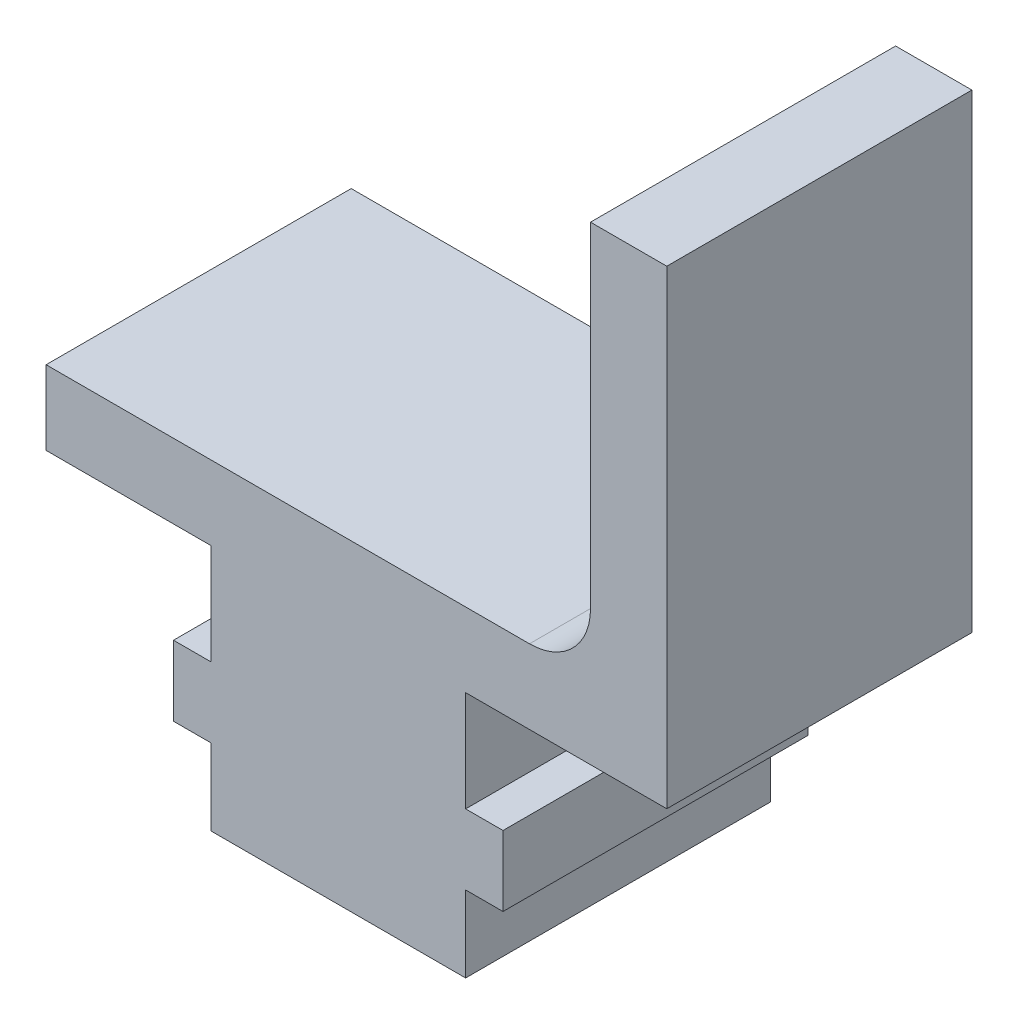
ISO-10303-21;
HEADER;
FILE_DESCRIPTION(('STEP AP214'),'2;1');
FILE_NAME('part.step','',(''),(''),'','','');
FILE_SCHEMA(('AUTOMOTIVE_DESIGN { 1 0 10303 214 1 1 1 1 }'));
ENDSEC;
DATA;
#1=APPLICATION_CONTEXT('core data for automotive mechanical design processes');
#2=APPLICATION_PROTOCOL_DEFINITION('international standard','automotive_design',2000,#1);
#3=PRODUCT_CONTEXT('',#1,'mechanical');
#4=PRODUCT('Part','Part','',(#3));
#5=PRODUCT_RELATED_PRODUCT_CATEGORY('part','',(#4));
#6=PRODUCT_DEFINITION_FORMATION('','',#4);
#7=PRODUCT_DEFINITION_CONTEXT('part definition',#1,'design');
#8=PRODUCT_DEFINITION('design','',#6,#7);
#9=PRODUCT_DEFINITION_SHAPE('','',#8);
#10=(LENGTH_UNIT() NAMED_UNIT(*) SI_UNIT(.MILLI.,.METRE.));
#11=(NAMED_UNIT(*) PLANE_ANGLE_UNIT() SI_UNIT($,.RADIAN.));
#12=(NAMED_UNIT(*) SI_UNIT($,.STERADIAN.) SOLID_ANGLE_UNIT());
#13=UNCERTAINTY_MEASURE_WITH_UNIT(LENGTH_MEASURE(1.E-05),#10,'distance_accuracy_value','');
#14=(GEOMETRIC_REPRESENTATION_CONTEXT(3) GLOBAL_UNCERTAINTY_ASSIGNED_CONTEXT((#13)) GLOBAL_UNIT_ASSIGNED_CONTEXT((#10,
#11,#12)) REPRESENTATION_CONTEXT('',''));
#15=CARTESIAN_POINT('',(0.,0.,0.));
#16=DIRECTION('',(0.,0.,1.));
#17=DIRECTION('',(1.,0.,0.));
#18=AXIS2_PLACEMENT_3D('',#15,#16,#17);
#19=CARTESIAN_POINT('',(-6.858,0.,12.7));
#20=DIRECTION('',(0.,1.,0.));
#21=DIRECTION('',(0.,0.,1.));
#22=AXIS2_PLACEMENT_3D('',#19,#20,#21);
#23=PLANE('',#22);
#24=DIRECTION('',(1.,0.,0.));
#25=VECTOR('',#24,1.);
#26=CARTESIAN_POINT('',(-6.858,0.,0.));
#27=LINE('',#26,#25);
#28=CARTESIAN_POINT('',(-6.858,0.,0.));
#29=VERTEX_POINT('',#28);
#30=CARTESIAN_POINT('',(0.,0.,0.));
#31=VERTEX_POINT('',#30);
#32=EDGE_CURVE('E190',#29,#31,#27,.T.);
#33=ORIENTED_EDGE('',*,*,#32,.T.);
#34=DIRECTION('',(0.,0.,-1.));
#35=VECTOR('',#34,1.);
#36=CARTESIAN_POINT('',(0.,0.,12.7));
#37=LINE('',#36,#35);
#38=CARTESIAN_POINT('',(0.,0.,12.7));
#39=VERTEX_POINT('',#38);
#40=EDGE_CURVE('E171',#39,#31,#37,.T.);
#41=ORIENTED_EDGE('',*,*,#40,.F.);
#42=DIRECTION('',(1.,0.,0.));
#43=VECTOR('',#42,1.);
#44=CARTESIAN_POINT('',(-6.858,0.,12.7));
#45=LINE('',#44,#43);
#46=CARTESIAN_POINT('',(-6.858,0.,12.7));
#47=VERTEX_POINT('',#46);
#48=EDGE_CURVE('E178',#47,#39,#45,.T.);
#49=ORIENTED_EDGE('',*,*,#48,.F.);
#50=DIRECTION('',(0.,0.,-1.));
#51=VECTOR('',#50,1.);
#52=CARTESIAN_POINT('',(-6.858,0.,12.7));
#53=LINE('',#52,#51);
#54=EDGE_CURVE('E240',#47,#29,#53,.T.);
#55=ORIENTED_EDGE('',*,*,#54,.T.);
#56=EDGE_LOOP('',(#33,#41,#49,#55));
#57=FACE_BOUND('',#56,.T.);
#58=ADVANCED_FACE('F36',(#57),#23,.F.);
#59=CARTESIAN_POINT('',(0.,0.,12.7));
#60=DIRECTION('',(1.,0.,0.));
#61=DIRECTION('',(0.,1.,0.));
#62=AXIS2_PLACEMENT_3D('',#59,#60,#61);
#63=PLANE('',#62);
#64=DIRECTION('',(0.,-1.,0.));
#65=VECTOR('',#64,1.);
#66=CARTESIAN_POINT('',(0.,0.,0.));
#67=LINE('',#66,#65);
#68=CARTESIAN_POINT('',(0.,-4.191,0.));
#69=VERTEX_POINT('',#68);
#70=EDGE_CURVE('E273',#31,#69,#67,.T.);
#71=ORIENTED_EDGE('',*,*,#70,.T.);
#72=DIRECTION('',(0.,0.,-1.));
#73=VECTOR('',#72,1.);
#74=CARTESIAN_POINT('',(0.,-4.191,12.7));
#75=LINE('',#74,#73);
#76=CARTESIAN_POINT('',(0.,-4.191,12.7));
#77=VERTEX_POINT('',#76);
#78=EDGE_CURVE('E174',#77,#69,#75,.T.);
#79=ORIENTED_EDGE('',*,*,#78,.F.);
#80=DIRECTION('',(0.,-1.,0.));
#81=VECTOR('',#80,1.);
#82=CARTESIAN_POINT('',(0.,0.,12.7));
#83=LINE('',#82,#81);
#84=EDGE_CURVE('E167',#39,#77,#83,.T.);
#85=ORIENTED_EDGE('',*,*,#84,.F.);
#86=ORIENTED_EDGE('',*,*,#40,.T.);
#87=EDGE_LOOP('',(#71,#79,#85,#86));
#88=FACE_BOUND('',#87,.T.);
#89=ADVANCED_FACE('F169',(#88),#63,.F.);
#90=CARTESIAN_POINT('',(0.,-4.191,12.7));
#91=DIRECTION('',(0.,-1.,0.));
#92=DIRECTION('',(1.,0.,0.));
#93=AXIS2_PLACEMENT_3D('',#90,#91,#92);
#94=PLANE('',#93);
#95=DIRECTION('',(-1.,0.,0.));
#96=VECTOR('',#95,1.);
#97=CARTESIAN_POINT('',(0.,-4.191,0.));
#98=LINE('',#97,#96);
#99=CARTESIAN_POINT('',(-1.55575,-4.191,0.));
#100=VERTEX_POINT('',#99);
#101=EDGE_CURVE('E271',#69,#100,#98,.T.);
#102=ORIENTED_EDGE('',*,*,#101,.T.);
#103=DIRECTION('',(0.,0.,-1.));
#104=VECTOR('',#103,1.);
#105=CARTESIAN_POINT('',(-1.55575,-4.191,12.7));
#106=LINE('',#105,#104);
#107=CARTESIAN_POINT('',(-1.55575,-4.191,12.7));
#108=VERTEX_POINT('',#107);
#109=EDGE_CURVE('E195',#108,#100,#106,.T.);
#110=ORIENTED_EDGE('',*,*,#109,.F.);
#111=DIRECTION('',(-1.,0.,0.));
#112=VECTOR('',#111,1.);
#113=CARTESIAN_POINT('',(0.,-4.191,12.7));
#114=LINE('',#113,#112);
#115=EDGE_CURVE('E177',#77,#108,#114,.T.);
#116=ORIENTED_EDGE('',*,*,#115,.F.);
#117=ORIENTED_EDGE('',*,*,#78,.T.);
#118=EDGE_LOOP('',(#102,#110,#116,#117));
#119=FACE_BOUND('',#118,.T.);
#120=ADVANCED_FACE('F309',(#119),#94,.F.);
#121=CARTESIAN_POINT('',(-1.55575,-4.191,12.7));
#122=DIRECTION('',(1.,0.,0.));
#123=DIRECTION('',(0.,0.,-1.));
#124=AXIS2_PLACEMENT_3D('',#121,#122,#123);
#125=PLANE('',#124);
#126=DIRECTION('',(0.,-1.,0.));
#127=VECTOR('',#126,1.);
#128=CARTESIAN_POINT('',(-1.55575,-4.191,0.));
#129=LINE('',#128,#127);
#130=CARTESIAN_POINT('',(-1.55575,-7.112,0.));
#131=VERTEX_POINT('',#130);
#132=EDGE_CURVE('E269',#100,#131,#129,.T.);
#133=ORIENTED_EDGE('',*,*,#132,.T.);
#134=DIRECTION('',(0.,0.,-1.));
#135=VECTOR('',#134,1.);
#136=CARTESIAN_POINT('',(-1.55575,-7.112,12.7));
#137=LINE('',#136,#135);
#138=CARTESIAN_POINT('',(-1.55575,-7.112,12.7));
#139=VERTEX_POINT('',#138);
#140=EDGE_CURVE('E201',#139,#131,#137,.T.);
#141=ORIENTED_EDGE('',*,*,#140,.F.);
#142=DIRECTION('',(0.,-1.,0.));
#143=VECTOR('',#142,1.);
#144=CARTESIAN_POINT('',(-1.55575,-4.191,12.7));
#145=LINE('',#144,#143);
#146=EDGE_CURVE('E303',#108,#139,#145,.T.);
#147=ORIENTED_EDGE('',*,*,#146,.F.);
#148=ORIENTED_EDGE('',*,*,#109,.T.);
#149=EDGE_LOOP('',(#133,#141,#147,#148));
#150=FACE_BOUND('',#149,.T.);
#151=ADVANCED_FACE('F313',(#150),#125,.F.);
#152=CARTESIAN_POINT('',(-1.55575,-7.112,12.7));
#153=DIRECTION('',(0.,1.,0.));
#154=DIRECTION('',(0.,0.,1.));
#155=AXIS2_PLACEMENT_3D('',#152,#153,#154);
#156=PLANE('',#155);
#157=DIRECTION('',(1.,0.,0.));
#158=VECTOR('',#157,1.);
#159=CARTESIAN_POINT('',(-1.55575,-7.112,0.));
#160=LINE('',#159,#158);
#161=CARTESIAN_POINT('',(0.,-7.112,0.));
#162=VERTEX_POINT('',#161);
#163=EDGE_CURVE('E267',#131,#162,#160,.T.);
#164=ORIENTED_EDGE('',*,*,#163,.T.);
#165=DIRECTION('',(0.,0.,-1.));
#166=VECTOR('',#165,1.);
#167=CARTESIAN_POINT('',(0.,-7.112,12.7));
#168=LINE('',#167,#166);
#169=CARTESIAN_POINT('',(0.,-7.112,12.7));
#170=VERTEX_POINT('',#169);
#171=EDGE_CURVE('E204',#170,#162,#168,.T.);
#172=ORIENTED_EDGE('',*,*,#171,.F.);
#173=DIRECTION('',(1.,0.,0.));
#174=VECTOR('',#173,1.);
#175=CARTESIAN_POINT('',(-1.55575,-7.112,12.7));
#176=LINE('',#175,#174);
#177=EDGE_CURVE('E301',#139,#170,#176,.T.);
#178=ORIENTED_EDGE('',*,*,#177,.F.);
#179=ORIENTED_EDGE('',*,*,#140,.T.);
#180=EDGE_LOOP('',(#164,#172,#178,#179));
#181=FACE_BOUND('',#180,.T.);
#182=ADVANCED_FACE('F318',(#181),#156,.F.);
#183=CARTESIAN_POINT('',(0.,-7.112,12.7));
#184=DIRECTION('',(1.,0.,0.));
#185=DIRECTION('',(0.,1.,0.));
#186=AXIS2_PLACEMENT_3D('',#183,#184,#185);
#187=PLANE('',#186);
#188=DIRECTION('',(0.,-1.,0.));
#189=VECTOR('',#188,1.);
#190=CARTESIAN_POINT('',(0.,-7.112,0.));
#191=LINE('',#190,#189);
#192=CARTESIAN_POINT('',(0.,-10.287,0.));
#193=VERTEX_POINT('',#192);
#194=EDGE_CURVE('E265',#162,#193,#191,.T.);
#195=ORIENTED_EDGE('',*,*,#194,.T.);
#196=DIRECTION('',(0.,0.,-1.));
#197=VECTOR('',#196,1.);
#198=CARTESIAN_POINT('',(0.,-10.287,12.7));
#199=LINE('',#198,#197);
#200=CARTESIAN_POINT('',(0.,-10.287,12.7));
#201=VERTEX_POINT('',#200);
#202=EDGE_CURVE('E207',#201,#193,#199,.T.);
#203=ORIENTED_EDGE('',*,*,#202,.F.);
#204=DIRECTION('',(0.,-1.,0.));
#205=VECTOR('',#204,1.);
#206=CARTESIAN_POINT('',(0.,-7.112,12.7));
#207=LINE('',#206,#205);
#208=EDGE_CURVE('E299',#170,#201,#207,.T.);
#209=ORIENTED_EDGE('',*,*,#208,.F.);
#210=ORIENTED_EDGE('',*,*,#171,.T.);
#211=EDGE_LOOP('',(#195,#203,#209,#210));
#212=FACE_BOUND('',#211,.T.);
#213=ADVANCED_FACE('F324',(#212),#187,.F.);
#214=CARTESIAN_POINT('',(0.,-10.287,12.7));
#215=DIRECTION('',(0.,1.,0.));
#216=DIRECTION('',(0.,0.,1.));
#217=AXIS2_PLACEMENT_3D('',#214,#215,#216);
#218=PLANE('',#217);
#219=DIRECTION('',(1.,0.,0.));
#220=VECTOR('',#219,1.);
#221=CARTESIAN_POINT('',(0.,-10.287,0.));
#222=LINE('',#221,#220);
#223=CARTESIAN_POINT('',(10.6045,-10.287,0.));
#224=VERTEX_POINT('',#223);
#225=EDGE_CURVE('E263',#193,#224,#222,.T.);
#226=ORIENTED_EDGE('',*,*,#225,.T.);
#227=DIRECTION('',(0.,0.,-1.));
#228=VECTOR('',#227,1.);
#229=CARTESIAN_POINT('',(10.6045,-10.287,12.7));
#230=LINE('',#229,#228);
#231=CARTESIAN_POINT('',(10.6045,-10.287,12.7));
#232=VERTEX_POINT('',#231);
#233=EDGE_CURVE('E210',#232,#224,#230,.T.);
#234=ORIENTED_EDGE('',*,*,#233,.F.);
#235=DIRECTION('',(1.,0.,0.));
#236=VECTOR('',#235,1.);
#237=CARTESIAN_POINT('',(0.,-10.287,12.7));
#238=LINE('',#237,#236);
#239=EDGE_CURVE('E297',#201,#232,#238,.T.);
#240=ORIENTED_EDGE('',*,*,#239,.F.);
#241=ORIENTED_EDGE('',*,*,#202,.T.);
#242=EDGE_LOOP('',(#226,#234,#240,#241));
#243=FACE_BOUND('',#242,.T.);
#244=ADVANCED_FACE('F328',(#243),#218,.F.);
#245=CARTESIAN_POINT('',(10.6045,-10.287,12.7));
#246=DIRECTION('',(-1.,0.,0.));
#247=DIRECTION('',(0.,0.,1.));
#248=AXIS2_PLACEMENT_3D('',#245,#246,#247);
#249=PLANE('',#248);
#250=DIRECTION('',(0.,1.,0.));
#251=VECTOR('',#250,1.);
#252=CARTESIAN_POINT('',(10.6045,-10.287,0.));
#253=LINE('',#252,#251);
#254=CARTESIAN_POINT('',(10.6045,-7.112,0.));
#255=VERTEX_POINT('',#254);
#256=EDGE_CURVE('E261',#224,#255,#253,.T.);
#257=ORIENTED_EDGE('',*,*,#256,.T.);
#258=DIRECTION('',(0.,0.,-1.));
#259=VECTOR('',#258,1.);
#260=CARTESIAN_POINT('',(10.6045,-7.112,12.7));
#261=LINE('',#260,#259);
#262=CARTESIAN_POINT('',(10.6045,-7.112,12.7));
#263=VERTEX_POINT('',#262);
#264=EDGE_CURVE('E213',#263,#255,#261,.T.);
#265=ORIENTED_EDGE('',*,*,#264,.F.);
#266=DIRECTION('',(0.,1.,0.));
#267=VECTOR('',#266,1.);
#268=CARTESIAN_POINT('',(10.6045,-10.287,12.7));
#269=LINE('',#268,#267);
#270=EDGE_CURVE('E295',#232,#263,#269,.T.);
#271=ORIENTED_EDGE('',*,*,#270,.F.);
#272=ORIENTED_EDGE('',*,*,#233,.T.);
#273=EDGE_LOOP('',(#257,#265,#271,#272));
#274=FACE_BOUND('',#273,.T.);
#275=ADVANCED_FACE('F333',(#274),#249,.F.);
#276=CARTESIAN_POINT('',(10.6045,-7.112,12.7));
#277=DIRECTION('',(0.,1.,0.));
#278=DIRECTION('',(0.,0.,1.));
#279=AXIS2_PLACEMENT_3D('',#276,#277,#278);
#280=PLANE('',#279);
#281=DIRECTION('',(1.,0.,0.));
#282=VECTOR('',#281,1.);
#283=CARTESIAN_POINT('',(10.6045,-7.112,0.));
#284=LINE('',#283,#282);
#285=CARTESIAN_POINT('',(12.16025,-7.112,0.));
#286=VERTEX_POINT('',#285);
#287=EDGE_CURVE('E259',#255,#286,#284,.T.);
#288=ORIENTED_EDGE('',*,*,#287,.T.);
#289=DIRECTION('',(0.,0.,-1.));
#290=VECTOR('',#289,1.);
#291=CARTESIAN_POINT('',(12.16025,-7.112,12.7));
#292=LINE('',#291,#290);
#293=CARTESIAN_POINT('',(12.16025,-7.112,12.7));
#294=VERTEX_POINT('',#293);
#295=EDGE_CURVE('E216',#294,#286,#292,.T.);
#296=ORIENTED_EDGE('',*,*,#295,.F.);
#297=DIRECTION('',(1.,0.,0.));
#298=VECTOR('',#297,1.);
#299=CARTESIAN_POINT('',(10.6045,-7.112,12.7));
#300=LINE('',#299,#298);
#301=EDGE_CURVE('E293',#263,#294,#300,.T.);
#302=ORIENTED_EDGE('',*,*,#301,.F.);
#303=ORIENTED_EDGE('',*,*,#264,.T.);
#304=EDGE_LOOP('',(#288,#296,#302,#303));
#305=FACE_BOUND('',#304,.T.);
#306=ADVANCED_FACE('F339',(#305),#280,.F.);
#307=CARTESIAN_POINT('',(12.16025,-7.112,12.7));
#308=DIRECTION('',(-1.,0.,0.));
#309=DIRECTION('',(0.,0.,1.));
#310=AXIS2_PLACEMENT_3D('',#307,#308,#309);
#311=PLANE('',#310);
#312=DIRECTION('',(0.,1.,0.));
#313=VECTOR('',#312,1.);
#314=CARTESIAN_POINT('',(12.16025,-7.112,0.));
#315=LINE('',#314,#313);
#316=CARTESIAN_POINT('',(12.16025,-4.191,0.));
#317=VERTEX_POINT('',#316);
#318=EDGE_CURVE('E257',#286,#317,#315,.T.);
#319=ORIENTED_EDGE('',*,*,#318,.T.);
#320=DIRECTION('',(0.,0.,-1.));
#321=VECTOR('',#320,1.);
#322=CARTESIAN_POINT('',(12.16025,-4.191,12.7));
#323=LINE('',#322,#321);
#324=CARTESIAN_POINT('',(12.16025,-4.191,12.7));
#325=VERTEX_POINT('',#324);
#326=EDGE_CURVE('E219',#325,#317,#323,.T.);
#327=ORIENTED_EDGE('',*,*,#326,.F.);
#328=DIRECTION('',(0.,1.,0.));
#329=VECTOR('',#328,1.);
#330=CARTESIAN_POINT('',(12.16025,-7.112,12.7));
#331=LINE('',#330,#329);
#332=EDGE_CURVE('E291',#294,#325,#331,.T.);
#333=ORIENTED_EDGE('',*,*,#332,.F.);
#334=ORIENTED_EDGE('',*,*,#295,.T.);
#335=EDGE_LOOP('',(#319,#327,#333,#334));
#336=FACE_BOUND('',#335,.T.);
#337=ADVANCED_FACE('F343',(#336),#311,.F.);
#338=CARTESIAN_POINT('',(12.16025,-4.191,12.7));
#339=DIRECTION('',(0.,-1.,0.));
#340=DIRECTION('',(1.,0.,0.));
#341=AXIS2_PLACEMENT_3D('',#338,#339,#340);
#342=PLANE('',#341);
#343=DIRECTION('',(-1.,0.,0.));
#344=VECTOR('',#343,1.);
#345=CARTESIAN_POINT('',(12.16025,-4.191,0.));
#346=LINE('',#345,#344);
#347=CARTESIAN_POINT('',(10.6045,-4.191,0.));
#348=VERTEX_POINT('',#347);
#349=EDGE_CURVE('E255',#317,#348,#346,.T.);
#350=ORIENTED_EDGE('',*,*,#349,.T.);
#351=DIRECTION('',(0.,0.,-1.));
#352=VECTOR('',#351,1.);
#353=CARTESIAN_POINT('',(10.6045,-4.191,12.7));
#354=LINE('',#353,#352);
#355=CARTESIAN_POINT('',(10.6045,-4.191,12.7));
#356=VERTEX_POINT('',#355);
#357=EDGE_CURVE('E222',#356,#348,#354,.T.);
#358=ORIENTED_EDGE('',*,*,#357,.F.);
#359=DIRECTION('',(-1.,0.,0.));
#360=VECTOR('',#359,1.);
#361=CARTESIAN_POINT('',(12.16025,-4.191,12.7));
#362=LINE('',#361,#360);
#363=EDGE_CURVE('E289',#325,#356,#362,.T.);
#364=ORIENTED_EDGE('',*,*,#363,.F.);
#365=ORIENTED_EDGE('',*,*,#326,.T.);
#366=EDGE_LOOP('',(#350,#358,#364,#365));
#367=FACE_BOUND('',#366,.T.);
#368=ADVANCED_FACE('F348',(#367),#342,.F.);
#369=CARTESIAN_POINT('',(10.6045,-4.191,12.7));
#370=DIRECTION('',(-1.,0.,0.));
#371=DIRECTION('',(0.,0.,1.));
#372=AXIS2_PLACEMENT_3D('',#369,#370,#371);
#373=PLANE('',#372);
#374=DIRECTION('',(0.,1.,0.));
#375=VECTOR('',#374,1.);
#376=CARTESIAN_POINT('',(10.6045,-4.191,0.));
#377=LINE('',#376,#375);
#378=CARTESIAN_POINT('',(10.6045,0.,0.));
#379=VERTEX_POINT('',#378);
#380=EDGE_CURVE('E253',#348,#379,#377,.T.);
#381=ORIENTED_EDGE('',*,*,#380,.T.);
#382=DIRECTION('',(0.,0.,-1.));
#383=VECTOR('',#382,1.);
#384=CARTESIAN_POINT('',(10.6045,0.,12.7));
#385=LINE('',#384,#383);
#386=CARTESIAN_POINT('',(10.6045,0.,12.7));
#387=VERTEX_POINT('',#386);
#388=EDGE_CURVE('E225',#387,#379,#385,.T.);
#389=ORIENTED_EDGE('',*,*,#388,.F.);
#390=DIRECTION('',(0.,1.,0.));
#391=VECTOR('',#390,1.);
#392=CARTESIAN_POINT('',(10.6045,-4.191,12.7));
#393=LINE('',#392,#391);
#394=EDGE_CURVE('E287',#356,#387,#393,.T.);
#395=ORIENTED_EDGE('',*,*,#394,.F.);
#396=ORIENTED_EDGE('',*,*,#357,.T.);
#397=EDGE_LOOP('',(#381,#389,#395,#396));
#398=FACE_BOUND('',#397,.T.);
#399=ADVANCED_FACE('F354',(#398),#373,.F.);
#400=CARTESIAN_POINT('',(10.6045,0.,12.7));
#401=DIRECTION('',(0.,1.,0.));
#402=DIRECTION('',(0.,0.,1.));
#403=AXIS2_PLACEMENT_3D('',#400,#401,#402);
#404=PLANE('',#403);
#405=DIRECTION('',(1.,0.,0.));
#406=VECTOR('',#405,1.);
#407=CARTESIAN_POINT('',(10.6045,0.,0.));
#408=LINE('',#407,#406);
#409=CARTESIAN_POINT('',(18.97725,0.,0.));
#410=VERTEX_POINT('',#409);
#411=EDGE_CURVE('E251',#379,#410,#408,.T.);
#412=ORIENTED_EDGE('',*,*,#411,.T.);
#413=DIRECTION('',(0.,0.,-1.));
#414=VECTOR('',#413,1.);
#415=CARTESIAN_POINT('',(18.97725,0.,12.7));
#416=LINE('',#415,#414);
#417=CARTESIAN_POINT('',(18.97725,0.,12.7));
#418=VERTEX_POINT('',#417);
#419=EDGE_CURVE('E228',#418,#410,#416,.T.);
#420=ORIENTED_EDGE('',*,*,#419,.F.);
#421=DIRECTION('',(1.,0.,0.));
#422=VECTOR('',#421,1.);
#423=CARTESIAN_POINT('',(10.6045,0.,12.7));
#424=LINE('',#423,#422);
#425=EDGE_CURVE('E285',#387,#418,#424,.T.);
#426=ORIENTED_EDGE('',*,*,#425,.F.);
#427=ORIENTED_EDGE('',*,*,#388,.T.);
#428=EDGE_LOOP('',(#412,#420,#426,#427));
#429=FACE_BOUND('',#428,.T.);
#430=ADVANCED_FACE('F358',(#429),#404,.F.);
#431=CARTESIAN_POINT('',(18.97725,0.,12.7));
#432=DIRECTION('',(-1.,0.,0.));
#433=DIRECTION('',(0.,-1.,0.));
#434=AXIS2_PLACEMENT_3D('',#431,#432,#433);
#435=PLANE('',#434);
#436=DIRECTION('',(0.,1.,0.));
#437=VECTOR('',#436,1.);
#438=CARTESIAN_POINT('',(18.97725,0.,0.));
#439=LINE('',#438,#437);
#440=CARTESIAN_POINT('',(18.97725,19.558,0.));
#441=VERTEX_POINT('',#440);
#442=EDGE_CURVE('E249',#410,#441,#439,.T.);
#443=ORIENTED_EDGE('',*,*,#442,.T.);
#444=DIRECTION('',(0.,0.,-1.));
#445=VECTOR('',#444,1.);
#446=CARTESIAN_POINT('',(18.97725,19.558,12.7));
#447=LINE('',#446,#445);
#448=CARTESIAN_POINT('',(18.97725,19.558,12.7));
#449=VERTEX_POINT('',#448);
#450=EDGE_CURVE('E231',#449,#441,#447,.T.);
#451=ORIENTED_EDGE('',*,*,#450,.F.);
#452=DIRECTION('',(0.,1.,0.));
#453=VECTOR('',#452,1.);
#454=CARTESIAN_POINT('',(18.97725,0.,12.7));
#455=LINE('',#454,#453);
#456=EDGE_CURVE('E283',#418,#449,#455,.T.);
#457=ORIENTED_EDGE('',*,*,#456,.F.);
#458=ORIENTED_EDGE('',*,*,#419,.T.);
#459=EDGE_LOOP('',(#443,#451,#457,#458));
#460=FACE_BOUND('',#459,.T.);
#461=ADVANCED_FACE('F363',(#460),#435,.F.);
#462=CARTESIAN_POINT('',(18.97725,19.558,12.7));
#463=DIRECTION('',(0.,-1.,0.));
#464=DIRECTION('',(0.,0.,-1.));
#465=AXIS2_PLACEMENT_3D('',#462,#463,#464);
#466=PLANE('',#465);
#467=DIRECTION('',(-1.,0.,0.));
#468=VECTOR('',#467,1.);
#469=CARTESIAN_POINT('',(18.97725,19.558,0.));
#470=LINE('',#469,#468);
#471=CARTESIAN_POINT('',(15.80225,19.558,0.));
#472=VERTEX_POINT('',#471);
#473=EDGE_CURVE('E247',#441,#472,#470,.T.);
#474=ORIENTED_EDGE('',*,*,#473,.T.);
#475=DIRECTION('',(0.,0.,-1.));
#476=VECTOR('',#475,1.);
#477=CARTESIAN_POINT('',(15.80225,19.558,12.7));
#478=LINE('',#477,#476);
#479=CARTESIAN_POINT('',(15.80225,19.558,12.7));
#480=VERTEX_POINT('',#479);
#481=EDGE_CURVE('E234',#480,#472,#478,.T.);
#482=ORIENTED_EDGE('',*,*,#481,.F.);
#483=DIRECTION('',(-1.,0.,0.));
#484=VECTOR('',#483,1.);
#485=CARTESIAN_POINT('',(18.97725,19.558,12.7));
#486=LINE('',#485,#484);
#487=EDGE_CURVE('E281',#449,#480,#486,.T.);
#488=ORIENTED_EDGE('',*,*,#487,.F.);
#489=ORIENTED_EDGE('',*,*,#450,.T.);
#490=EDGE_LOOP('',(#474,#482,#488,#489));
#491=FACE_BOUND('',#490,.T.);
#492=ADVANCED_FACE('F368',(#491),#466,.F.);
#493=CARTESIAN_POINT('',(15.80225,19.558,12.7));
#494=DIRECTION('',(1.,0.,0.));
#495=DIRECTION('',(0.,0.,-1.));
#496=AXIS2_PLACEMENT_3D('',#493,#494,#495);
#497=PLANE('',#496);
#498=DIRECTION('',(0.,-1.,0.));
#499=VECTOR('',#498,1.);
#500=CARTESIAN_POINT('',(15.80225,19.558,0.));
#501=LINE('',#500,#499);
#502=CARTESIAN_POINT('',(15.80225,5.629,0.));
#503=VERTEX_POINT('',#502);
#504=EDGE_CURVE('E245',#472,#503,#501,.T.);
#505=ORIENTED_EDGE('',*,*,#504,.T.);
#506=DIRECTION('',(0.,0.,-1.));
#507=VECTOR('',#506,1.);
#508=CARTESIAN_POINT('',(15.80225,5.629,12.7));
#509=LINE('',#508,#507);
#510=CARTESIAN_POINT('',(15.80225,5.629,12.7));
#511=VERTEX_POINT('',#510);
#512=EDGE_CURVE('E51',#503,#511,#509,.F.);
#513=ORIENTED_EDGE('',*,*,#512,.T.);
#514=DIRECTION('',(0.,-1.,0.));
#515=VECTOR('',#514,1.);
#516=CARTESIAN_POINT('',(15.80225,19.558,12.7));
#517=LINE('',#516,#515);
#518=EDGE_CURVE('E279',#480,#511,#517,.T.);
#519=ORIENTED_EDGE('',*,*,#518,.F.);
#520=ORIENTED_EDGE('',*,*,#481,.T.);
#521=EDGE_LOOP('',(#505,#513,#519,#520));
#522=FACE_BOUND('',#521,.T.);
#523=ADVANCED_FACE('F370',(#522),#497,.F.);
#524=CARTESIAN_POINT('',(15.80225,3.089,12.7));
#525=DIRECTION('',(0.,-1.,0.));
#526=DIRECTION('',(1.,0.,0.));
#527=AXIS2_PLACEMENT_3D('',#524,#525,#526);
#528=PLANE('',#527);
#529=DIRECTION('',(-1.,0.,0.));
#530=VECTOR('',#529,1.);
#531=CARTESIAN_POINT('',(15.80225,3.089,12.7));
#532=LINE('',#531,#530);
#533=CARTESIAN_POINT('',(13.26225,3.089,12.7));
#534=VERTEX_POINT('',#533);
#535=CARTESIAN_POINT('',(-6.858,3.089,12.7));
#536=VERTEX_POINT('',#535);
#537=EDGE_CURVE('E277',#534,#536,#532,.T.);
#538=ORIENTED_EDGE('',*,*,#537,.F.);
#539=DIRECTION('',(0.,0.,-1.));
#540=VECTOR('',#539,1.);
#541=CARTESIAN_POINT('',(13.26225,3.089,0.));
#542=LINE('',#541,#540);
#543=CARTESIAN_POINT('',(13.26225,3.089,0.));
#544=VERTEX_POINT('',#543);
#545=EDGE_CURVE('E191',#534,#544,#542,.T.);
#546=ORIENTED_EDGE('',*,*,#545,.T.);
#547=DIRECTION('',(-1.,0.,0.));
#548=VECTOR('',#547,1.);
#549=CARTESIAN_POINT('',(15.80225,3.089,0.));
#550=LINE('',#549,#548);
#551=CARTESIAN_POINT('',(-6.858,3.089,0.));
#552=VERTEX_POINT('',#551);
#553=EDGE_CURVE('E243',#544,#552,#550,.T.);
#554=ORIENTED_EDGE('',*,*,#553,.T.);
#555=DIRECTION('',(0.,0.,-1.));
#556=VECTOR('',#555,1.);
#557=CARTESIAN_POINT('',(-6.858,3.089,12.7));
#558=LINE('',#557,#556);
#559=EDGE_CURVE('E237',#536,#552,#558,.T.);
#560=ORIENTED_EDGE('',*,*,#559,.F.);
#561=EDGE_LOOP('',(#538,#546,#554,#560));
#562=FACE_BOUND('',#561,.T.);
#563=ADVANCED_FACE('F372',(#562),#528,.F.);
#564=CARTESIAN_POINT('',(-6.858,3.089,12.7));
#565=DIRECTION('',(1.,0.,0.));
#566=DIRECTION('',(0.,0.,-1.));
#567=AXIS2_PLACEMENT_3D('',#564,#565,#566);
#568=PLANE('',#567);
#569=DIRECTION('',(0.,-1.,0.));
#570=VECTOR('',#569,1.);
#571=CARTESIAN_POINT('',(-6.858,3.089,0.));
#572=LINE('',#571,#570);
#573=EDGE_CURVE('E187',#552,#29,#572,.T.);
#574=ORIENTED_EDGE('',*,*,#573,.T.);
#575=ORIENTED_EDGE('',*,*,#54,.F.);
#576=DIRECTION('',(0.,-1.,0.));
#577=VECTOR('',#576,1.);
#578=CARTESIAN_POINT('',(-6.858,3.089,12.7));
#579=LINE('',#578,#577);
#580=EDGE_CURVE('E183',#536,#47,#579,.T.);
#581=ORIENTED_EDGE('',*,*,#580,.F.);
#582=ORIENTED_EDGE('',*,*,#559,.T.);
#583=EDGE_LOOP('',(#574,#575,#581,#582));
#584=FACE_BOUND('',#583,.T.);
#585=ADVANCED_FACE('F378',(#584),#568,.F.);
#586=CARTESIAN_POINT('',(0.,0.,12.7));
#587=DIRECTION('',(0.,0.,-1.));
#588=DIRECTION('',(-1.,0.,0.));
#589=AXIS2_PLACEMENT_3D('',#586,#587,#588);
#590=PLANE('',#589);
#591=ORIENTED_EDGE('',*,*,#48,.T.);
#592=ORIENTED_EDGE('',*,*,#84,.T.);
#593=ORIENTED_EDGE('',*,*,#115,.T.);
#594=ORIENTED_EDGE('',*,*,#146,.T.);
#595=ORIENTED_EDGE('',*,*,#177,.T.);
#596=ORIENTED_EDGE('',*,*,#208,.T.);
#597=ORIENTED_EDGE('',*,*,#239,.T.);
#598=ORIENTED_EDGE('',*,*,#270,.T.);
#599=ORIENTED_EDGE('',*,*,#301,.T.);
#600=ORIENTED_EDGE('',*,*,#332,.T.);
#601=ORIENTED_EDGE('',*,*,#363,.T.);
#602=ORIENTED_EDGE('',*,*,#394,.T.);
#603=ORIENTED_EDGE('',*,*,#425,.T.);
#604=ORIENTED_EDGE('',*,*,#456,.T.);
#605=ORIENTED_EDGE('',*,*,#487,.T.);
#606=ORIENTED_EDGE('',*,*,#518,.T.);
#607=CARTESIAN_POINT('',(13.26225,5.629,12.7));
#608=DIRECTION('',(0.,0.,-1.));
#609=DIRECTION('',(-1.,0.,0.));
#610=AXIS2_PLACEMENT_3D('',#607,#608,#609);
#611=CIRCLE('',#610,2.54);
#612=EDGE_CURVE('E11',#511,#534,#611,.T.);
#613=ORIENTED_EDGE('',*,*,#612,.T.);
#614=ORIENTED_EDGE('',*,*,#537,.T.);
#615=ORIENTED_EDGE('',*,*,#580,.T.);
#616=EDGE_LOOP('',(#591,#592,#593,#594,#595,#596,#597,#598,#599,#600,#601,#602,#603,#604,#605,
#606,#613,#614,#615));
#617=FACE_BOUND('',#616,.T.);
#618=ADVANCED_FACE('F181',(#617),#590,.F.);
#619=CARTESIAN_POINT('',(0.,0.,0.));
#620=DIRECTION('',(0.,0.,-1.));
#621=DIRECTION('',(-1.,0.,0.));
#622=AXIS2_PLACEMENT_3D('',#619,#620,#621);
#623=PLANE('',#622);
#624=ORIENTED_EDGE('',*,*,#32,.F.);
#625=ORIENTED_EDGE('',*,*,#573,.F.);
#626=ORIENTED_EDGE('',*,*,#553,.F.);
#627=CARTESIAN_POINT('',(13.26225,5.629,0.));
#628=DIRECTION('',(0.,0.,-1.));
#629=DIRECTION('',(-1.,0.,0.));
#630=AXIS2_PLACEMENT_3D('',#627,#628,#629);
#631=CIRCLE('',#630,2.54);
#632=EDGE_CURVE('E44',#544,#503,#631,.F.);
#633=ORIENTED_EDGE('',*,*,#632,.T.);
#634=ORIENTED_EDGE('',*,*,#504,.F.);
#635=ORIENTED_EDGE('',*,*,#473,.F.);
#636=ORIENTED_EDGE('',*,*,#442,.F.);
#637=ORIENTED_EDGE('',*,*,#411,.F.);
#638=ORIENTED_EDGE('',*,*,#380,.F.);
#639=ORIENTED_EDGE('',*,*,#349,.F.);
#640=ORIENTED_EDGE('',*,*,#318,.F.);
#641=ORIENTED_EDGE('',*,*,#287,.F.);
#642=ORIENTED_EDGE('',*,*,#256,.F.);
#643=ORIENTED_EDGE('',*,*,#225,.F.);
#644=ORIENTED_EDGE('',*,*,#194,.F.);
#645=ORIENTED_EDGE('',*,*,#163,.F.);
#646=ORIENTED_EDGE('',*,*,#132,.F.);
#647=ORIENTED_EDGE('',*,*,#101,.F.);
#648=ORIENTED_EDGE('',*,*,#70,.F.);
#649=EDGE_LOOP('',(#624,#625,#626,#633,#634,#635,#636,#637,#638,#639,#640,#641,#642,#643,#644,
#645,#646,#647,#648));
#650=FACE_BOUND('',#649,.T.);
#651=ADVANCED_FACE('F447',(#650),#623,.T.);
#652=CARTESIAN_POINT('',(13.26225,5.629,12.7));
#653=DIRECTION('',(0.,0.,1.));
#654=DIRECTION('',(1.,0.,0.));
#655=AXIS2_PLACEMENT_3D('',#652,#653,#654);
#656=CYLINDRICAL_SURFACE('',#655,2.54);
#657=ORIENTED_EDGE('',*,*,#612,.F.);
#658=ORIENTED_EDGE('',*,*,#512,.F.);
#659=ORIENTED_EDGE('',*,*,#632,.F.);
#660=ORIENTED_EDGE('',*,*,#545,.F.);
#661=EDGE_LOOP('',(#657,#658,#659,#660));
#662=FACE_BOUND('',#661,.T.);
#663=ADVANCED_FACE('F38',(#662),#656,.F.);
#664=CLOSED_SHELL('',(#58,#89,#120,#151,#182,#213,#244,#275,#306,#337,#368,#399,#430,#461,#492,
#523,#563,#585,#618,#651,#663));
#665=MANIFOLD_SOLID_BREP('B2',#664);
#666=ADVANCED_BREP_SHAPE_REPRESENTATION('',(#18,#665),#14);
#667=SHAPE_DEFINITION_REPRESENTATION(#9,#666);
ENDSEC;
END-ISO-10303-21;
